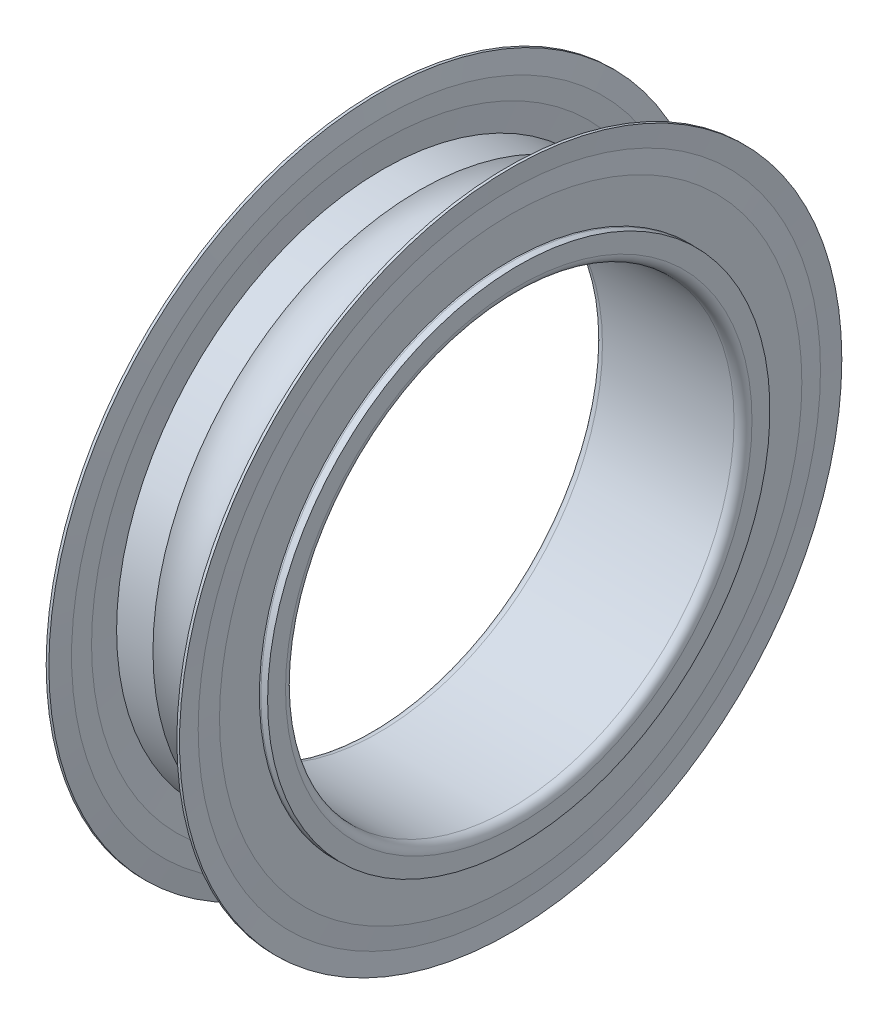
ISO-10303-21;
HEADER;
FILE_DESCRIPTION(('STEP AP214'),'2;1');
FILE_NAME('part.step','',(''),(''),'','','');
FILE_SCHEMA(('AUTOMOTIVE_DESIGN { 1 0 10303 214 1 1 1 1 }'));
ENDSEC;
DATA;
#1=APPLICATION_CONTEXT('core data for automotive mechanical design processes');
#2=APPLICATION_PROTOCOL_DEFINITION('international standard','automotive_design',2000,#1);
#3=PRODUCT_CONTEXT('',#1,'mechanical');
#4=PRODUCT('Part','Part','',(#3));
#5=PRODUCT_RELATED_PRODUCT_CATEGORY('part','',(#4));
#6=PRODUCT_DEFINITION_FORMATION('','',#4);
#7=PRODUCT_DEFINITION_CONTEXT('part definition',#1,'design');
#8=PRODUCT_DEFINITION('design','',#6,#7);
#9=PRODUCT_DEFINITION_SHAPE('','',#8);
#10=(LENGTH_UNIT() NAMED_UNIT(*) SI_UNIT(.MILLI.,.METRE.));
#11=(NAMED_UNIT(*) PLANE_ANGLE_UNIT() SI_UNIT($,.RADIAN.));
#12=(NAMED_UNIT(*) SI_UNIT($,.STERADIAN.) SOLID_ANGLE_UNIT());
#13=UNCERTAINTY_MEASURE_WITH_UNIT(LENGTH_MEASURE(1.E-05),#10,'distance_accuracy_value','');
#14=(GEOMETRIC_REPRESENTATION_CONTEXT(3) GLOBAL_UNCERTAINTY_ASSIGNED_CONTEXT((#13)) GLOBAL_UNIT_ASSIGNED_CONTEXT((#10,
#11,#12)) REPRESENTATION_CONTEXT('',''));
#15=CARTESIAN_POINT('',(0.,0.,0.));
#16=DIRECTION('',(0.,0.,1.));
#17=DIRECTION('',(1.,0.,0.));
#18=AXIS2_PLACEMENT_3D('',#15,#16,#17);
#19=CARTESIAN_POINT('',(2.5,0.,0.));
#20=DIRECTION('',(1.,0.,0.));
#21=DIRECTION('',(0.,0.,-1.));
#22=AXIS2_PLACEMENT_3D('',#19,#20,#21);
#23=TOROIDAL_SURFACE('',#22,9.75,1.1905);
#24=CARTESIAN_POINT('',(1.66645920915651,0.,0.));
#25=DIRECTION('',(-1.,0.,0.));
#26=DIRECTION('',(0.,0.,1.));
#27=AXIS2_PLACEMENT_3D('',#24,#25,#26);
#28=CIRCLE('',#27,8.9);
#29=CARTESIAN_POINT('',(1.66645920915651,0.,8.9));
#30=VERTEX_POINT('',#29);
#31=EDGE_CURVE('E257',#30,#30,#28,.T.);
#32=ORIENTED_EDGE('',*,*,#31,.F.);
#33=EDGE_LOOP('',(#32));
#34=FACE_BOUND('',#33,.T.);
#35=CARTESIAN_POINT('',(3.3335407908435,0.,0.));
#36=DIRECTION('',(-1.,0.,0.));
#37=DIRECTION('',(0.,0.,1.));
#38=AXIS2_PLACEMENT_3D('',#35,#36,#37);
#39=CIRCLE('',#38,8.9);
#40=CARTESIAN_POINT('',(3.3335407908435,0.,8.9));
#41=VERTEX_POINT('',#40);
#42=EDGE_CURVE('E260',#41,#41,#39,.F.);
#43=ORIENTED_EDGE('',*,*,#42,.F.);
#44=EDGE_LOOP('',(#43));
#45=FACE_BOUND('',#44,.T.);
#46=ADVANCED_FACE('F14',(#34,#45),#23,.F.);
#47=CARTESIAN_POINT('',(50.,0.,0.));
#48=DIRECTION('',(-1.,0.,0.));
#49=DIRECTION('',(0.,0.,1.));
#50=AXIS2_PLACEMENT_3D('',#47,#48,#49);
#51=CYLINDRICAL_SURFACE('',#50,8.9);
#52=CARTESIAN_POINT('',(4.55,0.,0.));
#53=DIRECTION('',(-1.,0.,0.));
#54=DIRECTION('',(0.,0.,1.));
#55=AXIS2_PLACEMENT_3D('',#52,#53,#54);
#56=CIRCLE('',#55,8.9);
#57=CARTESIAN_POINT('',(4.55,0.,8.9));
#58=VERTEX_POINT('',#57);
#59=EDGE_CURVE('E18',#58,#58,#56,.T.);
#60=ORIENTED_EDGE('',*,*,#59,.T.);
#61=EDGE_LOOP('',(#60));
#62=FACE_BOUND('',#61,.T.);
#63=ORIENTED_EDGE('',*,*,#42,.T.);
#64=EDGE_LOOP('',(#63));
#65=FACE_BOUND('',#64,.T.);
#66=ADVANCED_FACE('F200',(#62,#65),#51,.T.);
#67=CARTESIAN_POINT('',(50.,0.,0.));
#68=DIRECTION('',(-1.,0.,0.));
#69=DIRECTION('',(0.,0.,1.));
#70=AXIS2_PLACEMENT_3D('',#67,#68,#69);
#71=CYLINDRICAL_SURFACE('',#70,8.9);
#72=ORIENTED_EDGE('',*,*,#31,.T.);
#73=EDGE_LOOP('',(#72));
#74=FACE_BOUND('',#73,.T.);
#75=CARTESIAN_POINT('',(0.449999999999999,0.,0.));
#76=DIRECTION('',(-1.,0.,0.));
#77=DIRECTION('',(0.,0.,1.));
#78=AXIS2_PLACEMENT_3D('',#75,#76,#77);
#79=CIRCLE('',#78,8.9);
#80=CARTESIAN_POINT('',(0.449999999999999,0.,8.9));
#81=VERTEX_POINT('',#80);
#82=EDGE_CURVE('E253',#81,#81,#79,.F.);
#83=ORIENTED_EDGE('',*,*,#82,.T.);
#84=EDGE_LOOP('',(#83));
#85=FACE_BOUND('',#84,.T.);
#86=ADVANCED_FACE('F196',(#74,#85),#71,.T.);
#87=CARTESIAN_POINT('',(4.55,12.4,0.));
#88=DIRECTION('',(-1.,0.,0.));
#89=DIRECTION('',(0.,0.,1.));
#90=AXIS2_PLACEMENT_3D('',#87,#88,#89);
#91=PLANE('',#90);
#92=ORIENTED_EDGE('',*,*,#59,.F.);
#93=EDGE_LOOP('',(#92));
#94=FACE_BOUND('',#93,.T.);
#95=CARTESIAN_POINT('',(4.55,0.,0.));
#96=DIRECTION('',(1.,0.,0.));
#97=DIRECTION('',(0.,0.,-1.));
#98=AXIS2_PLACEMENT_3D('',#95,#96,#97);
#99=CIRCLE('',#98,8.625);
#100=CARTESIAN_POINT('',(4.55,0.,-8.625));
#101=VERTEX_POINT('',#100);
#102=EDGE_CURVE('E180',#101,#101,#99,.F.);
#103=ORIENTED_EDGE('',*,*,#102,.T.);
#104=EDGE_LOOP('',(#103));
#105=FACE_BOUND('',#104,.T.);
#106=ADVANCED_FACE('F186',(#94,#105),#91,.F.);
#107=CARTESIAN_POINT('',(0.45,8.625,0.));
#108=DIRECTION('',(1.,0.,0.));
#109=DIRECTION('',(0.,0.,-1.));
#110=AXIS2_PLACEMENT_3D('',#107,#108,#109);
#111=PLANE('',#110);
#112=CARTESIAN_POINT('',(0.449999999999999,0.,0.));
#113=DIRECTION('',(-1.,0.,0.));
#114=DIRECTION('',(0.,0.,-1.));
#115=AXIS2_PLACEMENT_3D('',#112,#113,#114);
#116=CIRCLE('',#115,8.62500000335276);
#117=CARTESIAN_POINT('',(0.449999999999999,0.,-8.62500000335276));
#118=VERTEX_POINT('',#117);
#119=EDGE_CURVE('E145',#118,#118,#116,.F.);
#120=ORIENTED_EDGE('',*,*,#119,.T.);
#121=EDGE_LOOP('',(#120));
#122=FACE_BOUND('',#121,.T.);
#123=ORIENTED_EDGE('',*,*,#82,.F.);
#124=EDGE_LOOP('',(#123));
#125=FACE_BOUND('',#124,.T.);
#126=ADVANCED_FACE('F195',(#122,#125),#111,.F.);
#127=CARTESIAN_POINT('',(4.775,0.,0.));
#128=DIRECTION('',(1.,0.,0.));
#129=DIRECTION('',(0.,0.,-1.));
#130=AXIS2_PLACEMENT_3D('',#127,#128,#129);
#131=TOROIDAL_SURFACE('',#130,8.625,0.224999999999998);
#132=ORIENTED_EDGE('',*,*,#102,.F.);
#133=EDGE_LOOP('',(#132));
#134=FACE_BOUND('',#133,.T.);
#135=CARTESIAN_POINT('',(4.63680784679382,0.,0.));
#136=DIRECTION('',(-1.,0.,0.));
#137=DIRECTION('',(0.,0.,1.));
#138=AXIS2_PLACEMENT_3D('',#135,#136,#137);
#139=CIRCLE('',#138,8.44743894348066);
#140=CARTESIAN_POINT('',(4.63680784679382,0.,8.44743894348066));
#141=VERTEX_POINT('',#140);
#142=EDGE_CURVE('E140',#141,#141,#139,.T.);
#143=ORIENTED_EDGE('',*,*,#142,.T.);
#144=EDGE_LOOP('',(#143));
#145=FACE_BOUND('',#144,.T.);
#146=ADVANCED_FACE('F159',(#134,#145),#131,.F.);
#147=CARTESIAN_POINT('',(0.225000000000003,0.,0.));
#148=DIRECTION('',(1.,0.,0.));
#149=DIRECTION('',(0.,0.,-1.));
#150=AXIS2_PLACEMENT_3D('',#147,#148,#149);
#151=TOROIDAL_SURFACE('',#150,8.625,0.224999999999996);
#152=CARTESIAN_POINT('',(0.363192153206174,0.,0.));
#153=DIRECTION('',(1.,0.,0.));
#154=DIRECTION('',(0.,0.,-1.));
#155=AXIS2_PLACEMENT_3D('',#152,#153,#154);
#156=CIRCLE('',#155,8.44743894348066);
#157=CARTESIAN_POINT('',(0.363192153206174,0.,-8.44743894348066));
#158=VERTEX_POINT('',#157);
#159=EDGE_CURVE('E136',#158,#158,#156,.T.);
#160=ORIENTED_EDGE('',*,*,#159,.T.);
#161=EDGE_LOOP('',(#160));
#162=FACE_BOUND('',#161,.T.);
#163=ORIENTED_EDGE('',*,*,#119,.F.);
#164=EDGE_LOOP('',(#163));
#165=FACE_BOUND('',#164,.T.);
#166=ADVANCED_FACE('F153',(#162,#165),#151,.F.);
#167=CARTESIAN_POINT('',(4.55,0.,0.));
#168=DIRECTION('',(-1.,0.,0.));
#169=DIRECTION('',(0.,0.,1.));
#170=AXIS2_PLACEMENT_3D('',#167,#168,#169);
#171=CONICAL_SURFACE('',#170,9.7375,1.50360789266071);
#172=CARTESIAN_POINT('',(4.55,0.,0.));
#173=DIRECTION('',(-1.,0.,0.));
#174=DIRECTION('',(0.,0.,1.));
#175=AXIS2_PLACEMENT_3D('',#172,#173,#174);
#176=CIRCLE('',#175,9.7375);
#177=CARTESIAN_POINT('',(4.55,0.,9.7375));
#178=VERTEX_POINT('',#177);
#179=EDGE_CURVE('E139',#178,#178,#176,.F.);
#180=ORIENTED_EDGE('',*,*,#179,.F.);
#181=EDGE_LOOP('',(#180));
#182=FACE_BOUND('',#181,.T.);
#183=ORIENTED_EDGE('',*,*,#142,.F.);
#184=EDGE_LOOP('',(#183));
#185=FACE_BOUND('',#184,.T.);
#186=ADVANCED_FACE('F158',(#182,#185),#171,.F.);
#187=CARTESIAN_POINT('',(0.449999999999997,0.,0.));
#188=DIRECTION('',(1.,0.,0.));
#189=DIRECTION('',(0.,0.,-1.));
#190=AXIS2_PLACEMENT_3D('',#187,#188,#189);
#191=CONICAL_SURFACE('',#190,9.7375,1.50360789266071);
#192=ORIENTED_EDGE('',*,*,#159,.F.);
#193=EDGE_LOOP('',(#192));
#194=FACE_BOUND('',#193,.T.);
#195=CARTESIAN_POINT('',(0.449999999999997,0.,0.));
#196=DIRECTION('',(1.,0.,0.));
#197=DIRECTION('',(0.,0.,-1.));
#198=AXIS2_PLACEMENT_3D('',#195,#196,#197);
#199=CIRCLE('',#198,9.7375);
#200=CARTESIAN_POINT('',(0.449999999999997,0.,-9.7375));
#201=VERTEX_POINT('',#200);
#202=EDGE_CURVE('E249',#201,#201,#199,.F.);
#203=ORIENTED_EDGE('',*,*,#202,.F.);
#204=EDGE_LOOP('',(#203));
#205=FACE_BOUND('',#204,.T.);
#206=ADVANCED_FACE('F299',(#194,#205),#191,.F.);
#207=CARTESIAN_POINT('',(4.55,10.40625,0.));
#208=DIRECTION('',(-1.,0.,0.));
#209=DIRECTION('',(0.,0.,1.));
#210=AXIS2_PLACEMENT_3D('',#207,#208,#209);
#211=PLANE('',#210);
#212=CARTESIAN_POINT('',(4.55,0.,0.));
#213=DIRECTION('',(1.,0.,0.));
#214=DIRECTION('',(0.,0.,-1.));
#215=AXIS2_PLACEMENT_3D('',#212,#213,#214);
#216=CIRCLE('',#215,10.40625);
#217=CARTESIAN_POINT('',(4.55,0.,-10.40625));
#218=VERTEX_POINT('',#217);
#219=EDGE_CURVE('E246',#218,#218,#216,.T.);
#220=ORIENTED_EDGE('',*,*,#219,.F.);
#221=EDGE_LOOP('',(#220));
#222=FACE_BOUND('',#221,.T.);
#223=ORIENTED_EDGE('',*,*,#179,.T.);
#224=EDGE_LOOP('',(#223));
#225=FACE_BOUND('',#224,.T.);
#226=ADVANCED_FACE('F304',(#222,#225),#211,.T.);
#227=CARTESIAN_POINT('',(0.45,9.7375,0.));
#228=DIRECTION('',(1.,0.,0.));
#229=DIRECTION('',(0.,0.,-1.));
#230=AXIS2_PLACEMENT_3D('',#227,#228,#229);
#231=PLANE('',#230);
#232=ORIENTED_EDGE('',*,*,#202,.T.);
#233=EDGE_LOOP('',(#232));
#234=FACE_BOUND('',#233,.T.);
#235=CARTESIAN_POINT('',(0.449999999999999,0.,0.));
#236=DIRECTION('',(-1.,0.,0.));
#237=DIRECTION('',(0.,-1.,0.));
#238=AXIS2_PLACEMENT_3D('',#235,#236,#237);
#239=CIRCLE('',#238,10.40625);
#240=CARTESIAN_POINT('',(0.449999999999999,-10.40625,0.));
#241=VERTEX_POINT('',#240);
#242=EDGE_CURVE('E133',#241,#241,#239,.T.);
#243=ORIENTED_EDGE('',*,*,#242,.F.);
#244=EDGE_LOOP('',(#243));
#245=FACE_BOUND('',#244,.T.);
#246=ADVANCED_FACE('F309',(#234,#245),#231,.T.);
#247=CARTESIAN_POINT('',(4.64,0.,0.));
#248=DIRECTION('',(1.,0.,0.));
#249=DIRECTION('',(0.,0.,-1.));
#250=AXIS2_PLACEMENT_3D('',#247,#248,#249);
#251=CONICAL_SURFACE('',#250,11.075,1.43702065506807);
#252=CARTESIAN_POINT('',(4.64,0.,0.));
#253=DIRECTION('',(-1.,0.,0.));
#254=DIRECTION('',(0.,0.,1.));
#255=AXIS2_PLACEMENT_3D('',#252,#253,#254);
#256=CIRCLE('',#255,11.075);
#257=CARTESIAN_POINT('',(4.64,0.,11.075));
#258=VERTEX_POINT('',#257);
#259=EDGE_CURVE('E128',#258,#258,#256,.F.);
#260=ORIENTED_EDGE('',*,*,#259,.F.);
#261=EDGE_LOOP('',(#260));
#262=FACE_BOUND('',#261,.T.);
#263=ORIENTED_EDGE('',*,*,#219,.T.);
#264=EDGE_LOOP('',(#263));
#265=FACE_BOUND('',#264,.T.);
#266=ADVANCED_FACE('F315',(#262,#265),#251,.T.);
#267=CARTESIAN_POINT('',(0.360000000000001,0.,0.));
#268=DIRECTION('',(-1.,0.,0.));
#269=DIRECTION('',(0.,-1.,0.));
#270=AXIS2_PLACEMENT_3D('',#267,#268,#269);
#271=CONICAL_SURFACE('',#270,11.075,1.43702065506807);
#272=ORIENTED_EDGE('',*,*,#242,.T.);
#273=EDGE_LOOP('',(#272));
#274=FACE_BOUND('',#273,.T.);
#275=CARTESIAN_POINT('',(0.359999999999999,0.,0.));
#276=DIRECTION('',(-1.,0.,0.));
#277=DIRECTION('',(0.,0.,1.));
#278=AXIS2_PLACEMENT_3D('',#275,#276,#277);
#279=CIRCLE('',#278,11.075);
#280=CARTESIAN_POINT('',(0.359999999999999,0.,11.075));
#281=VERTEX_POINT('',#280);
#282=EDGE_CURVE('E123',#281,#281,#279,.T.);
#283=ORIENTED_EDGE('',*,*,#282,.F.);
#284=EDGE_LOOP('',(#283));
#285=FACE_BOUND('',#284,.T.);
#286=ADVANCED_FACE('F322',(#274,#285),#271,.T.);
#287=CARTESIAN_POINT('',(50.,0.,0.));
#288=DIRECTION('',(-1.,0.,0.));
#289=DIRECTION('',(0.,0.,1.));
#290=AXIS2_PLACEMENT_3D('',#287,#288,#289);
#291=CYLINDRICAL_SURFACE('',#290,11.075);
#292=CARTESIAN_POINT('',(4.73,0.,0.));
#293=DIRECTION('',(1.,0.,0.));
#294=DIRECTION('',(0.,0.,-1.));
#295=AXIS2_PLACEMENT_3D('',#292,#293,#294);
#296=CIRCLE('',#295,11.075);
#297=CARTESIAN_POINT('',(4.73,0.,-11.075));
#298=VERTEX_POINT('',#297);
#299=EDGE_CURVE('E118',#298,#298,#296,.F.);
#300=ORIENTED_EDGE('',*,*,#299,.T.);
#301=EDGE_LOOP('',(#300));
#302=FACE_BOUND('',#301,.T.);
#303=ORIENTED_EDGE('',*,*,#259,.T.);
#304=EDGE_LOOP('',(#303));
#305=FACE_BOUND('',#304,.T.);
#306=ADVANCED_FACE('F326',(#302,#305),#291,.T.);
#307=CARTESIAN_POINT('',(50.,0.,0.));
#308=DIRECTION('',(-1.,0.,0.));
#309=DIRECTION('',(0.,0.,1.));
#310=AXIS2_PLACEMENT_3D('',#307,#308,#309);
#311=CYLINDRICAL_SURFACE('',#310,11.075);
#312=ORIENTED_EDGE('',*,*,#282,.T.);
#313=EDGE_LOOP('',(#312));
#314=FACE_BOUND('',#313,.T.);
#315=CARTESIAN_POINT('',(0.269999999999999,0.,0.));
#316=DIRECTION('',(-1.,0.,0.));
#317=DIRECTION('',(0.,0.,1.));
#318=AXIS2_PLACEMENT_3D('',#315,#316,#317);
#319=CIRCLE('',#318,11.075);
#320=CARTESIAN_POINT('',(0.269999999999999,0.,11.075));
#321=VERTEX_POINT('',#320);
#322=EDGE_CURVE('E113',#321,#321,#319,.F.);
#323=ORIENTED_EDGE('',*,*,#322,.T.);
#324=EDGE_LOOP('',(#323));
#325=FACE_BOUND('',#324,.T.);
#326=ADVANCED_FACE('F330',(#314,#325),#311,.T.);
#327=CARTESIAN_POINT('',(4.73,0.,0.));
#328=DIRECTION('',(1.,0.,0.));
#329=DIRECTION('',(0.,0.,-1.));
#330=AXIS2_PLACEMENT_3D('',#327,#328,#329);
#331=CONICAL_SURFACE('',#330,11.075,1.50360789266071);
#332=CARTESIAN_POINT('',(4.685,0.,0.));
#333=DIRECTION('',(-1.,0.,0.));
#334=DIRECTION('',(0.,0.,1.));
#335=AXIS2_PLACEMENT_3D('',#332,#333,#334);
#336=CIRCLE('',#335,10.40625);
#337=CARTESIAN_POINT('',(4.685,0.,10.40625));
#338=VERTEX_POINT('',#337);
#339=EDGE_CURVE('E108',#338,#338,#336,.F.);
#340=ORIENTED_EDGE('',*,*,#339,.F.);
#341=EDGE_LOOP('',(#340));
#342=FACE_BOUND('',#341,.T.);
#343=ORIENTED_EDGE('',*,*,#299,.F.);
#344=EDGE_LOOP('',(#343));
#345=FACE_BOUND('',#344,.T.);
#346=ADVANCED_FACE('F334',(#342,#345),#331,.F.);
#347=CARTESIAN_POINT('',(0.269999999999999,0.,0.));
#348=DIRECTION('',(-1.,0.,0.));
#349=DIRECTION('',(0.,-1.,0.));
#350=AXIS2_PLACEMENT_3D('',#347,#348,#349);
#351=CONICAL_SURFACE('',#350,11.075,1.5036078926607);
#352=ORIENTED_EDGE('',*,*,#322,.F.);
#353=EDGE_LOOP('',(#352));
#354=FACE_BOUND('',#353,.T.);
#355=CARTESIAN_POINT('',(0.315000000000003,0.,0.));
#356=DIRECTION('',(1.,0.,0.));
#357=DIRECTION('',(0.,0.,-1.));
#358=AXIS2_PLACEMENT_3D('',#355,#356,#357);
#359=CIRCLE('',#358,10.40625);
#360=CARTESIAN_POINT('',(0.315000000000003,0.,-10.40625));
#361=VERTEX_POINT('',#360);
#362=EDGE_CURVE('E104',#361,#361,#359,.F.);
#363=ORIENTED_EDGE('',*,*,#362,.F.);
#364=EDGE_LOOP('',(#363));
#365=FACE_BOUND('',#364,.T.);
#366=ADVANCED_FACE('F338',(#354,#365),#351,.F.);
#367=CARTESIAN_POINT('',(4.685,0.,0.));
#368=DIRECTION('',(-1.,0.,0.));
#369=DIRECTION('',(0.,0.,1.));
#370=AXIS2_PLACEMENT_3D('',#367,#368,#369);
#371=CONICAL_SURFACE('',#370,10.40625,1.50360789266071);
#372=CARTESIAN_POINT('',(4.73,0.,0.));
#373=DIRECTION('',(-1.,0.,0.));
#374=DIRECTION('',(0.,0.,1.));
#375=AXIS2_PLACEMENT_3D('',#372,#373,#374);
#376=CIRCLE('',#375,9.7375);
#377=CARTESIAN_POINT('',(4.73,0.,9.7375));
#378=VERTEX_POINT('',#377);
#379=EDGE_CURVE('E107',#378,#378,#376,.F.);
#380=ORIENTED_EDGE('',*,*,#379,.F.);
#381=EDGE_LOOP('',(#380));
#382=FACE_BOUND('',#381,.T.);
#383=ORIENTED_EDGE('',*,*,#339,.T.);
#384=EDGE_LOOP('',(#383));
#385=FACE_BOUND('',#384,.T.);
#386=ADVANCED_FACE('F342',(#382,#385),#371,.T.);
#387=CARTESIAN_POINT('',(0.315000000000003,0.,0.));
#388=DIRECTION('',(1.,0.,0.));
#389=DIRECTION('',(0.,0.,-1.));
#390=AXIS2_PLACEMENT_3D('',#387,#388,#389);
#391=CONICAL_SURFACE('',#390,10.40625,1.5036078926607);
#392=ORIENTED_EDGE('',*,*,#362,.T.);
#393=EDGE_LOOP('',(#392));
#394=FACE_BOUND('',#393,.T.);
#395=CARTESIAN_POINT('',(0.269999999999997,0.,0.));
#396=DIRECTION('',(1.,0.,0.));
#397=DIRECTION('',(0.,0.,-1.));
#398=AXIS2_PLACEMENT_3D('',#395,#396,#397);
#399=CIRCLE('',#398,9.7375);
#400=CARTESIAN_POINT('',(0.269999999999997,0.,-9.7375));
#401=VERTEX_POINT('',#400);
#402=EDGE_CURVE('E239',#401,#401,#399,.F.);
#403=ORIENTED_EDGE('',*,*,#402,.F.);
#404=EDGE_LOOP('',(#403));
#405=FACE_BOUND('',#404,.T.);
#406=ADVANCED_FACE('F346',(#394,#405),#391,.T.);
#407=CARTESIAN_POINT('',(4.73,8.4,0.));
#408=DIRECTION('',(1.,0.,0.));
#409=DIRECTION('',(0.,0.,-1.));
#410=AXIS2_PLACEMENT_3D('',#407,#408,#409);
#411=PLANE('',#410);
#412=CARTESIAN_POINT('',(4.73,0.,0.));
#413=DIRECTION('',(1.,0.,0.));
#414=DIRECTION('',(0.,0.,-1.));
#415=AXIS2_PLACEMENT_3D('',#412,#413,#414);
#416=CIRCLE('',#415,8.40454592314952);
#417=CARTESIAN_POINT('',(4.73,0.,-8.40454592314952));
#418=VERTEX_POINT('',#417);
#419=EDGE_CURVE('E236',#418,#418,#416,.F.);
#420=ORIENTED_EDGE('',*,*,#419,.T.);
#421=EDGE_LOOP('',(#420));
#422=FACE_BOUND('',#421,.T.);
#423=ORIENTED_EDGE('',*,*,#379,.T.);
#424=EDGE_LOOP('',(#423));
#425=FACE_BOUND('',#424,.T.);
#426=ADVANCED_FACE('F350',(#422,#425),#411,.T.);
#427=CARTESIAN_POINT('',(0.27,9.7375,0.));
#428=DIRECTION('',(-1.,0.,0.));
#429=DIRECTION('',(0.,0.,1.));
#430=AXIS2_PLACEMENT_3D('',#427,#428,#429);
#431=PLANE('',#430);
#432=ORIENTED_EDGE('',*,*,#402,.T.);
#433=EDGE_LOOP('',(#432));
#434=FACE_BOUND('',#433,.T.);
#435=CARTESIAN_POINT('',(0.27,0.,0.));
#436=DIRECTION('',(1.,0.,0.));
#437=DIRECTION('',(0.,0.,-1.));
#438=AXIS2_PLACEMENT_3D('',#435,#436,#437);
#439=CIRCLE('',#438,8.40454592314952);
#440=CARTESIAN_POINT('',(0.27,0.,-8.40454592314952));
#441=VERTEX_POINT('',#440);
#442=EDGE_CURVE('E232',#441,#441,#439,.T.);
#443=ORIENTED_EDGE('',*,*,#442,.T.);
#444=EDGE_LOOP('',(#443));
#445=FACE_BOUND('',#444,.T.);
#446=ADVANCED_FACE('F353',(#434,#445),#431,.T.);
#447=CARTESIAN_POINT('',(4.775,0.,0.));
#448=DIRECTION('',(1.,0.,0.));
#449=DIRECTION('',(0.,0.,-1.));
#450=AXIS2_PLACEMENT_3D('',#447,#448,#449);
#451=TOROIDAL_SURFACE('',#450,8.625,0.224999999999998);
#452=ORIENTED_EDGE('',*,*,#419,.F.);
#453=EDGE_LOOP('',(#452));
#454=FACE_BOUND('',#453,.T.);
#455=CARTESIAN_POINT('',(4.775,0.,0.));
#456=DIRECTION('',(-1.,0.,0.));
#457=DIRECTION('',(0.,0.,1.));
#458=AXIS2_PLACEMENT_3D('',#455,#456,#457);
#459=CIRCLE('',#458,8.4);
#460=CARTESIAN_POINT('',(4.775,0.,8.4));
#461=VERTEX_POINT('',#460);
#462=EDGE_CURVE('E235',#461,#461,#459,.F.);
#463=ORIENTED_EDGE('',*,*,#462,.F.);
#464=EDGE_LOOP('',(#463));
#465=FACE_BOUND('',#464,.T.);
#466=ADVANCED_FACE('F94',(#454,#465),#451,.F.);
#467=CARTESIAN_POINT('',(0.225000000000003,0.,0.));
#468=DIRECTION('',(1.,0.,0.));
#469=DIRECTION('',(0.,0.,-1.));
#470=AXIS2_PLACEMENT_3D('',#467,#468,#469);
#471=TOROIDAL_SURFACE('',#470,8.625,0.224999999999996);
#472=CARTESIAN_POINT('',(0.225000000000003,0.,0.));
#473=DIRECTION('',(-1.,0.,0.));
#474=DIRECTION('',(0.,0.,1.));
#475=AXIS2_PLACEMENT_3D('',#472,#473,#474);
#476=CIRCLE('',#475,8.4);
#477=CARTESIAN_POINT('',(0.225000000000003,0.,8.4));
#478=VERTEX_POINT('',#477);
#479=EDGE_CURVE('E227',#478,#478,#476,.T.);
#480=ORIENTED_EDGE('',*,*,#479,.F.);
#481=EDGE_LOOP('',(#480));
#482=FACE_BOUND('',#481,.T.);
#483=ORIENTED_EDGE('',*,*,#442,.F.);
#484=EDGE_LOOP('',(#483));
#485=FACE_BOUND('',#484,.T.);
#486=ADVANCED_FACE('F89',(#482,#485),#471,.F.);
#487=CARTESIAN_POINT('',(50.,0.,0.));
#488=DIRECTION('',(-1.,0.,0.));
#489=DIRECTION('',(0.,0.,1.));
#490=AXIS2_PLACEMENT_3D('',#487,#488,#489);
#491=CYLINDRICAL_SURFACE('',#490,8.4);
#492=ORIENTED_EDGE('',*,*,#462,.T.);
#493=EDGE_LOOP('',(#492));
#494=FACE_BOUND('',#493,.T.);
#495=CARTESIAN_POINT('',(5.,0.,0.));
#496=DIRECTION('',(-1.,0.,0.));
#497=DIRECTION('',(0.,0.,1.));
#498=AXIS2_PLACEMENT_3D('',#495,#496,#497);
#499=CIRCLE('',#498,8.4);
#500=CARTESIAN_POINT('',(5.,0.,8.4));
#501=VERTEX_POINT('',#500);
#502=EDGE_CURVE('E222',#501,#501,#499,.F.);
#503=ORIENTED_EDGE('',*,*,#502,.F.);
#504=EDGE_LOOP('',(#503));
#505=FACE_BOUND('',#504,.T.);
#506=ADVANCED_FACE('F85',(#494,#505),#491,.T.);
#507=CARTESIAN_POINT('',(50.,0.,0.));
#508=DIRECTION('',(-1.,0.,0.));
#509=DIRECTION('',(0.,0.,1.));
#510=AXIS2_PLACEMENT_3D('',#507,#508,#509);
#511=CYLINDRICAL_SURFACE('',#510,8.4);
#512=CARTESIAN_POINT('',(0.,0.,0.));
#513=DIRECTION('',(-1.,0.,0.));
#514=DIRECTION('',(0.,0.,1.));
#515=AXIS2_PLACEMENT_3D('',#512,#513,#514);
#516=CIRCLE('',#515,8.4);
#517=CARTESIAN_POINT('',(0.,0.,8.4));
#518=VERTEX_POINT('',#517);
#519=EDGE_CURVE('E220',#518,#518,#516,.T.);
#520=ORIENTED_EDGE('',*,*,#519,.F.);
#521=EDGE_LOOP('',(#520));
#522=FACE_BOUND('',#521,.T.);
#523=ORIENTED_EDGE('',*,*,#479,.T.);
#524=EDGE_LOOP('',(#523));
#525=FACE_BOUND('',#524,.T.);
#526=ADVANCED_FACE('F81',(#522,#525),#511,.T.);
#527=CARTESIAN_POINT('',(5.,7.8,0.));
#528=DIRECTION('',(1.,0.,0.));
#529=DIRECTION('',(0.,0.,-1.));
#530=AXIS2_PLACEMENT_3D('',#527,#528,#529);
#531=PLANE('',#530);
#532=CARTESIAN_POINT('',(5.,0.,0.));
#533=DIRECTION('',(1.,0.,0.));
#534=DIRECTION('',(0.,0.,-1.));
#535=AXIS2_PLACEMENT_3D('',#532,#533,#534);
#536=CIRCLE('',#535,7.8);
#537=CARTESIAN_POINT('',(5.,0.,-7.8));
#538=VERTEX_POINT('',#537);
#539=EDGE_CURVE('E65',#538,#538,#536,.T.);
#540=ORIENTED_EDGE('',*,*,#539,.F.);
#541=EDGE_LOOP('',(#540));
#542=FACE_BOUND('',#541,.T.);
#543=ORIENTED_EDGE('',*,*,#502,.T.);
#544=EDGE_LOOP('',(#543));
#545=FACE_BOUND('',#544,.T.);
#546=ADVANCED_FACE('F71',(#542,#545),#531,.T.);
#547=CARTESIAN_POINT('',(0.,8.8,0.));
#548=DIRECTION('',(-1.,0.,0.));
#549=DIRECTION('',(0.,0.,1.));
#550=AXIS2_PLACEMENT_3D('',#547,#548,#549);
#551=PLANE('',#550);
#552=ORIENTED_EDGE('',*,*,#519,.T.);
#553=EDGE_LOOP('',(#552));
#554=FACE_BOUND('',#553,.T.);
#555=CARTESIAN_POINT('',(0.,0.,0.));
#556=DIRECTION('',(-1.,0.,0.));
#557=DIRECTION('',(0.,0.,-1.));
#558=AXIS2_PLACEMENT_3D('',#555,#556,#557);
#559=CIRCLE('',#558,7.8);
#560=CARTESIAN_POINT('',(0.,0.,-7.8));
#561=VERTEX_POINT('',#560);
#562=EDGE_CURVE('E27',#561,#561,#559,.T.);
#563=ORIENTED_EDGE('',*,*,#562,.F.);
#564=EDGE_LOOP('',(#563));
#565=FACE_BOUND('',#564,.T.);
#566=ADVANCED_FACE('F80',(#554,#565),#551,.T.);
#567=CARTESIAN_POINT('',(4.7,0.,0.));
#568=DIRECTION('',(1.,0.,0.));
#569=DIRECTION('',(0.,0.,-1.));
#570=AXIS2_PLACEMENT_3D('',#567,#568,#569);
#571=TOROIDAL_SURFACE('',#570,7.8,0.300000000000003);
#572=CARTESIAN_POINT('',(4.7,0.,0.));
#573=DIRECTION('',(-1.,0.,0.));
#574=DIRECTION('',(0.,0.,1.));
#575=AXIS2_PLACEMENT_3D('',#572,#573,#574);
#576=CIRCLE('',#575,7.5);
#577=CARTESIAN_POINT('',(4.7,0.,7.5));
#578=VERTEX_POINT('',#577);
#579=EDGE_CURVE('E22',#578,#578,#576,.T.);
#580=ORIENTED_EDGE('',*,*,#579,.T.);
#581=EDGE_LOOP('',(#580));
#582=FACE_BOUND('',#581,.T.);
#583=ORIENTED_EDGE('',*,*,#539,.T.);
#584=EDGE_LOOP('',(#583));
#585=FACE_BOUND('',#584,.T.);
#586=ADVANCED_FACE('F45',(#582,#585),#571,.T.);
#587=CARTESIAN_POINT('',(0.300000000000002,0.,0.));
#588=DIRECTION('',(1.,0.,0.));
#589=DIRECTION('',(0.,0.,-1.));
#590=AXIS2_PLACEMENT_3D('',#587,#588,#589);
#591=TOROIDAL_SURFACE('',#590,7.8,0.300000000000002);
#592=ORIENTED_EDGE('',*,*,#562,.T.);
#593=EDGE_LOOP('',(#592));
#594=FACE_BOUND('',#593,.T.);
#595=CARTESIAN_POINT('',(0.300000000000002,0.,0.));
#596=DIRECTION('',(-1.,0.,0.));
#597=DIRECTION('',(0.,0.,1.));
#598=AXIS2_PLACEMENT_3D('',#595,#596,#597);
#599=CIRCLE('',#598,7.5);
#600=CARTESIAN_POINT('',(0.300000000000002,0.,7.5));
#601=VERTEX_POINT('',#600);
#602=EDGE_CURVE('E10',#601,#601,#599,.F.);
#603=ORIENTED_EDGE('',*,*,#602,.T.);
#604=EDGE_LOOP('',(#603));
#605=FACE_BOUND('',#604,.T.);
#606=ADVANCED_FACE('F39',(#594,#605),#591,.T.);
#607=CARTESIAN_POINT('',(50.,0.,0.));
#608=DIRECTION('',(-1.,0.,0.));
#609=DIRECTION('',(0.,0.,1.));
#610=AXIS2_PLACEMENT_3D('',#607,#608,#609);
#611=CYLINDRICAL_SURFACE('',#610,7.5);
#612=ORIENTED_EDGE('',*,*,#602,.F.);
#613=EDGE_LOOP('',(#612));
#614=FACE_BOUND('',#613,.T.);
#615=ORIENTED_EDGE('',*,*,#579,.F.);
#616=EDGE_LOOP('',(#615));
#617=FACE_BOUND('',#616,.T.);
#618=ADVANCED_FACE('F44',(#614,#617),#611,.F.);
#619=CLOSED_SHELL('',(#46,#66,#86,#106,#126,#146,#166,#186,#206,#226,#246,#266,#286,#306,#326,
#346,#366,#386,#406,#426,#446,#466,#486,#506,#526,#546,#566,#586,#606,#618));
#620=MANIFOLD_SOLID_BREP('B1',#619);
#621=ADVANCED_BREP_SHAPE_REPRESENTATION('',(#18,#620),#14);
#622=SHAPE_DEFINITION_REPRESENTATION(#9,#621);
ENDSEC;
END-ISO-10303-21;
